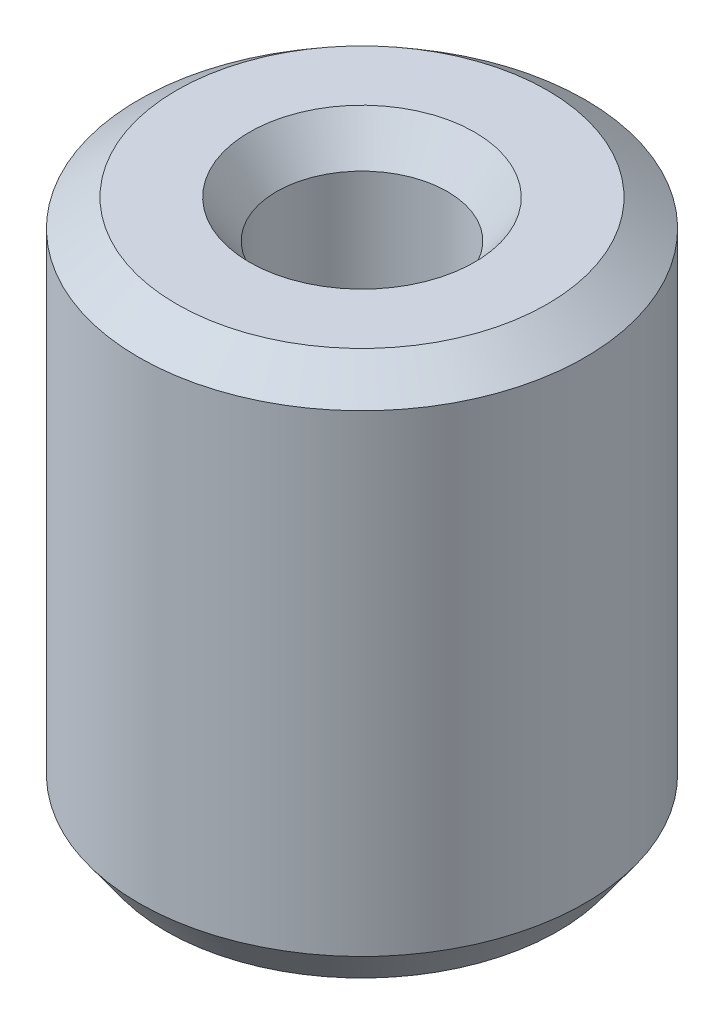
ISO-10303-21;
HEADER;
FILE_DESCRIPTION(('STEP AP214'),'2;1');
FILE_NAME('part.step','',(''),(''),'','','');
FILE_SCHEMA(('AUTOMOTIVE_DESIGN { 1 0 10303 214 1 1 1 1 }'));
ENDSEC;
DATA;
#1=APPLICATION_CONTEXT('core data for automotive mechanical design processes');
#2=APPLICATION_PROTOCOL_DEFINITION('international standard','automotive_design',2000,#1);
#3=PRODUCT_CONTEXT('',#1,'mechanical');
#4=PRODUCT('Part','Part','',(#3));
#5=PRODUCT_RELATED_PRODUCT_CATEGORY('part','',(#4));
#6=PRODUCT_DEFINITION_FORMATION('','',#4);
#7=PRODUCT_DEFINITION_CONTEXT('part definition',#1,'design');
#8=PRODUCT_DEFINITION('design','',#6,#7);
#9=PRODUCT_DEFINITION_SHAPE('','',#8);
#10=(LENGTH_UNIT() NAMED_UNIT(*) SI_UNIT(.MILLI.,.METRE.));
#11=(NAMED_UNIT(*) PLANE_ANGLE_UNIT() SI_UNIT($,.RADIAN.));
#12=(NAMED_UNIT(*) SI_UNIT($,.STERADIAN.) SOLID_ANGLE_UNIT());
#13=UNCERTAINTY_MEASURE_WITH_UNIT(LENGTH_MEASURE(1.E-05),#10,'distance_accuracy_value','');
#14=(GEOMETRIC_REPRESENTATION_CONTEXT(3) GLOBAL_UNCERTAINTY_ASSIGNED_CONTEXT((#13)) GLOBAL_UNIT_ASSIGNED_CONTEXT((#10,
#11,#12)) REPRESENTATION_CONTEXT('',''));
#15=CARTESIAN_POINT('',(0.,0.,0.));
#16=DIRECTION('',(0.,0.,1.));
#17=DIRECTION('',(1.,0.,0.));
#18=AXIS2_PLACEMENT_3D('',#15,#16,#17);
#19=CARTESIAN_POINT('',(0.,78.301453840789,0.));
#20=DIRECTION('',(0.,-1.,0.));
#21=DIRECTION('',(0.,0.,-1.));
#22=AXIS2_PLACEMENT_3D('',#19,#20,#21);
#23=CYLINDRICAL_SURFACE('',#22,32.5);
#24=CARTESIAN_POINT('',(0.,5.51533695774471,0.));
#25=DIRECTION('',(0.,1.,0.));
#26=DIRECTION('',(0.,0.,1.));
#27=AXIS2_PLACEMENT_3D('',#24,#25,#26);
#28=CIRCLE('',#27,32.5);
#29=CARTESIAN_POINT('',(0.,5.5153369577447,-32.5));
#30=VERTEX_POINT('',#29);
#31=EDGE_CURVE('E10',#30,#30,#28,.T.);
#32=CARTESIAN_POINT('',(0.,74.3437350221567,0.));
#33=DIRECTION('',(0.,1.,0.));
#34=DIRECTION('',(0.,0.,1.));
#35=AXIS2_PLACEMENT_3D('',#32,#33,#34);
#36=CIRCLE('',#35,32.5);
#37=CARTESIAN_POINT('',(0.,74.3437350221567,-32.5));
#38=VERTEX_POINT('',#37);
#39=EDGE_CURVE('E50',#38,#38,#36,.F.);
#40=CARTESIAN_POINT('',(0.,5.5153369577447,-32.5));
#41=CARTESIAN_POINT('',(0.,6.23229943758232,-32.5));
#42=CARTESIAN_POINT('',(0.,6.94926191741995,-32.5));
#43=CARTESIAN_POINT('',(0.,8.3831868770952,-32.5));
#44=CARTESIAN_POINT('',(0.,9.10014935693282,-32.5));
#45=CARTESIAN_POINT('',(0.,10.5340743166081,-32.5));
#46=CARTESIAN_POINT('',(0.,11.2510367964457,-32.5));
#47=CARTESIAN_POINT('',(0.,12.684961756121,-32.5));
#48=CARTESIAN_POINT('',(0.,13.4019242359586,-32.5));
#49=CARTESIAN_POINT('',(0.,14.8358491956338,-32.5));
#50=CARTESIAN_POINT('',(0.,15.5528116754715,-32.5));
#51=CARTESIAN_POINT('',(0.,16.9867366351467,-32.5));
#52=CARTESIAN_POINT('',(0.,17.7036991149843,-32.5));
#53=CARTESIAN_POINT('',(0.,19.1376240746596,-32.5));
#54=CARTESIAN_POINT('',(0.,19.8545865544972,-32.5));
#55=CARTESIAN_POINT('',(0.,21.2885115141725,-32.5));
#56=CARTESIAN_POINT('',(0.,22.0054739940101,-32.5));
#57=CARTESIAN_POINT('',(0.,23.4393989536853,-32.5));
#58=CARTESIAN_POINT('',(0.,24.156361433523,-32.5));
#59=CARTESIAN_POINT('',(0.,25.5902863931982,-32.5));
#60=CARTESIAN_POINT('',(0.,26.3072488730358,-32.5));
#61=CARTESIAN_POINT('',(0.,27.7411738327111,-32.5));
#62=CARTESIAN_POINT('',(0.,28.4581363125487,-32.5));
#63=CARTESIAN_POINT('',(0.,29.892061272224,-32.5));
#64=CARTESIAN_POINT('',(0.,30.6090237520616,-32.5));
#65=CARTESIAN_POINT('',(0.,32.0429487117368,-32.5));
#66=CARTESIAN_POINT('',(0.,32.7599111915745,-32.5));
#67=CARTESIAN_POINT('',(0.,34.1938361512497,-32.5));
#68=CARTESIAN_POINT('',(0.,34.9107986310873,-32.5));
#69=CARTESIAN_POINT('',(0.,36.3447235907626,-32.5));
#70=CARTESIAN_POINT('',(0.,37.0616860706002,-32.5));
#71=CARTESIAN_POINT('',(0.,38.4956110302755,-32.5));
#72=CARTESIAN_POINT('',(0.,39.2125735101131,-32.5));
#73=CARTESIAN_POINT('',(0.,40.6464984697883,-32.5));
#74=CARTESIAN_POINT('',(0.,41.363460949626,-32.5));
#75=CARTESIAN_POINT('',(0.,42.7973859093012,-32.5));
#76=CARTESIAN_POINT('',(0.,43.5143483891389,-32.5));
#77=CARTESIAN_POINT('',(0.,44.9482733488141,-32.5));
#78=CARTESIAN_POINT('',(0.,45.6652358286517,-32.5));
#79=CARTESIAN_POINT('',(0.,47.099160788327,-32.5));
#80=CARTESIAN_POINT('',(0.,47.8161232681646,-32.5));
#81=CARTESIAN_POINT('',(0.,49.2500482278399,-32.5));
#82=CARTESIAN_POINT('',(0.,49.9670107076775,-32.5));
#83=CARTESIAN_POINT('',(0.,51.4009356673527,-32.5));
#84=CARTESIAN_POINT('',(0.,52.1178981471904,-32.5));
#85=CARTESIAN_POINT('',(0.,53.5518231068656,-32.5));
#86=CARTESIAN_POINT('',(0.,54.2687855867032,-32.5));
#87=CARTESIAN_POINT('',(0.,55.7027105463785,-32.5));
#88=CARTESIAN_POINT('',(0.,56.4196730262161,-32.5));
#89=CARTESIAN_POINT('',(0.,57.8535979858914,-32.5));
#90=CARTESIAN_POINT('',(0.,58.570560465729,-32.5));
#91=CARTESIAN_POINT('',(0.,60.0044854254042,-32.5));
#92=CARTESIAN_POINT('',(0.,60.7214479052419,-32.5));
#93=CARTESIAN_POINT('',(0.,62.1553728649171,-32.5));
#94=CARTESIAN_POINT('',(0.,62.8723353447547,-32.5));
#95=CARTESIAN_POINT('',(0.,64.30626030443,-32.5));
#96=CARTESIAN_POINT('',(0.,65.0232227842676,-32.5));
#97=CARTESIAN_POINT('',(0.,66.4571477439429,-32.5));
#98=CARTESIAN_POINT('',(0.,67.1741102237805,-32.5));
#99=CARTESIAN_POINT('',(0.,68.6080351834558,-32.5));
#100=CARTESIAN_POINT('',(0.,69.3249976632934,-32.5));
#101=CARTESIAN_POINT('',(0.,70.7589226229686,-32.5));
#102=CARTESIAN_POINT('',(0.,71.4758851028063,-32.5));
#103=CARTESIAN_POINT('',(0.,72.9098100624815,-32.5));
#104=CARTESIAN_POINT('',(0.,73.6267725423191,-32.5));
#105=CARTESIAN_POINT('',(0.,74.3437350221567,-32.5));
#106=B_SPLINE_CURVE_WITH_KNOTS('',3,(#40,#41,#42,#43,#44,#45,#46,#47,#48,#49,#50,#51,#52,#53,
#54,#55,#56,#57,#58,#59,#60,#61,#62,#63,#64,#65,#66,#67,#68,#69,#70,#71,#72,#73,#74,#75,#76,#77,
#78,#79,#80,#81,#82,#83,#84,#85,#86,#87,#88,#89,#90,#91,#92,#93,#94,#95,#96,#97,#98,#99,#100,
#101,#102,#103,#104,#105),.UNSPECIFIED.,.F.,.F.,(4,2,2,2,2,2,2,2,2,2,2,2,2,2,2,2,2,2,2,2,2,2,2,
2,2,2,2,2,2,2,2,2,4),(0.,2.15088743951287,4.30177487902575,6.45266231853864,8.60354975805151,
10.7544371975644,12.9053246370773,15.0562120765901,17.207099516103,19.3579869556159,
21.5088743951288,23.6597618346416,25.8106492741545,27.9615367136674,30.1124241531803,
32.2633115926932,34.414199032206,36.5650864717189,38.7159739112318,40.8668613507447,
43.0177487902575,45.1686362297704,47.3195236692833,49.4704111087962,51.621298548309,
53.7721859878219,55.9230734273348,58.0739608668477,60.2248483063605,62.3757357458734,
64.5266231853863,66.6775106248992,68.8283980644121),.UNSPECIFIED.);
#107=EDGE_CURVE('BSEAM39',#30,#38,#106,.T.);
#108=ORIENTED_EDGE('',*,*,#31,.T.);
#109=ORIENTED_EDGE('',*,*,#39,.T.);
#110=ORIENTED_EDGE('',*,*,#107,.T.);
#111=ORIENTED_EDGE('',*,*,#107,.F.);
#112=EDGE_LOOP('',(#108,#110,#109,#111));
#113=FACE_BOUND('',#112,.T.);
#114=ADVANCED_FACE('F39',(#113),#23,.T.);
#115=CARTESIAN_POINT('',(0.,78.301453840789,0.));
#116=DIRECTION('',(0.,1.,0.));
#117=DIRECTION('',(0.,0.,1.));
#118=AXIS2_PLACEMENT_3D('',#115,#116,#117);
#119=PLANE('',#118);
#120=CARTESIAN_POINT('',(0.,78.301453840789,0.));
#121=DIRECTION('',(0.,1.,0.));
#122=DIRECTION('',(0.,0.,1.));
#123=AXIS2_PLACEMENT_3D('',#120,#121,#122);
#124=CIRCLE('',#123,16.4065281727438);
#125=CARTESIAN_POINT('',(0.,78.301453840789,16.4065281727438));
#126=VERTEX_POINT('',#125);
#127=EDGE_CURVE('E58',#126,#126,#124,.F.);
#128=ORIENTED_EDGE('',*,*,#127,.T.);
#129=EDGE_LOOP('',(#128));
#130=FACE_BOUND('',#129,.T.);
#131=CARTESIAN_POINT('',(0.,78.301453840789,0.));
#132=DIRECTION('',(0.,1.,0.));
#133=DIRECTION('',(0.,0.,1.));
#134=AXIS2_PLACEMENT_3D('',#131,#132,#133);
#135=CIRCLE('',#134,26.9846630422555);
#136=CARTESIAN_POINT('',(0.,78.301453840789,26.9846630422555));
#137=VERTEX_POINT('',#136);
#138=EDGE_CURVE('E61',#137,#137,#135,.T.);
#139=ORIENTED_EDGE('',*,*,#138,.T.);
#140=EDGE_LOOP('',(#139));
#141=FACE_BOUND('',#140,.T.);
#142=ADVANCED_FACE('F88',(#130,#141),#119,.T.);
#143=CARTESIAN_POINT('',(0.,0.,0.));
#144=DIRECTION('',(0.,1.,0.));
#145=DIRECTION('',(0.,0.,1.));
#146=AXIS2_PLACEMENT_3D('',#143,#144,#145);
#147=PLANE('',#146);
#148=CARTESIAN_POINT('',(0.,0.,0.));
#149=DIRECTION('',(0.,1.,0.));
#150=DIRECTION('',(0.,0.,1.));
#151=AXIS2_PLACEMENT_3D('',#148,#149,#150);
#152=CIRCLE('',#151,17.9641463118559);
#153=CARTESIAN_POINT('',(0.,0.,17.9641463118559));
#154=VERTEX_POINT('',#153);
#155=EDGE_CURVE('E51',#154,#154,#152,.T.);
#156=ORIENTED_EDGE('',*,*,#155,.T.);
#157=EDGE_LOOP('',(#156));
#158=FACE_BOUND('',#157,.T.);
#159=CARTESIAN_POINT('',(0.,0.,0.));
#160=DIRECTION('',(0.,1.,0.));
#161=DIRECTION('',(0.,0.,1.));
#162=AXIS2_PLACEMENT_3D('',#159,#160,#161);
#163=CIRCLE('',#162,28.5422811813675);
#164=CARTESIAN_POINT('',(0.,0.,28.5422811813675));
#165=VERTEX_POINT('',#164);
#166=EDGE_CURVE('E54',#165,#165,#163,.F.);
#167=ORIENTED_EDGE('',*,*,#166,.T.);
#168=EDGE_LOOP('',(#167));
#169=FACE_BOUND('',#168,.T.);
#170=ADVANCED_FACE('F83',(#158,#169),#147,.F.);
#171=CARTESIAN_POINT('',(0.,78.301453840789,0.));
#172=DIRECTION('',(0.,-1.,0.));
#173=DIRECTION('',(0.,0.,-1.));
#174=AXIS2_PLACEMENT_3D('',#171,#172,#173);
#175=CYLINDRICAL_SURFACE('',#174,12.4488093541114);
#176=CARTESIAN_POINT('',(0.,72.7861168830445,0.));
#177=DIRECTION('',(0.,1.,0.));
#178=DIRECTION('',(0.,0.,1.));
#179=AXIS2_PLACEMENT_3D('',#176,#177,#178);
#180=CIRCLE('',#179,12.4488093541114);
#181=CARTESIAN_POINT('',(0.,72.7861168830444,-12.4488093541114));
#182=VERTEX_POINT('',#181);
#183=EDGE_CURVE('E67',#182,#182,#180,.T.);
#184=CARTESIAN_POINT('',(0.,3.9577188186323,0.));
#185=DIRECTION('',(0.,1.,0.));
#186=DIRECTION('',(0.,0.,1.));
#187=AXIS2_PLACEMENT_3D('',#184,#185,#186);
#188=CIRCLE('',#187,12.4488093541114);
#189=CARTESIAN_POINT('',(0.,3.9577188186323,-12.4488093541114));
#190=VERTEX_POINT('',#189);
#191=EDGE_CURVE('E69',#190,#190,#188,.F.);
#192=CARTESIAN_POINT('',(0.,72.7861168830444,-12.4488093541114));
#193=CARTESIAN_POINT('',(0.,72.0691544032068,-12.4488093541114));
#194=CARTESIAN_POINT('',(0.,71.3521919233692,-12.4488093541114));
#195=CARTESIAN_POINT('',(0.,69.9182669636939,-12.4488093541114));
#196=CARTESIAN_POINT('',(0.,69.2013044838563,-12.4488093541114));
#197=CARTESIAN_POINT('',(0.,67.7673795241811,-12.4488093541114));
#198=CARTESIAN_POINT('',(0.,67.0504170443434,-12.4488093541114));
#199=CARTESIAN_POINT('',(0.,65.6164920846682,-12.4488093541114));
#200=CARTESIAN_POINT('',(0.,64.8995296048306,-12.4488093541114));
#201=CARTESIAN_POINT('',(0.,63.4656046451553,-12.4488093541114));
#202=CARTESIAN_POINT('',(0.,62.7486421653177,-12.4488093541114));
#203=CARTESIAN_POINT('',(0.,61.3147172056424,-12.4488093541114));
#204=CARTESIAN_POINT('',(0.,60.5977547258048,-12.4488093541114));
#205=CARTESIAN_POINT('',(0.,59.1638297661295,-12.4488093541114));
#206=CARTESIAN_POINT('',(0.,58.4468672862919,-12.4488093541114));
#207=CARTESIAN_POINT('',(0.,57.0129423266167,-12.4488093541114));
#208=CARTESIAN_POINT('',(0.,56.295979846779,-12.4488093541114));
#209=CARTESIAN_POINT('',(0.,54.8620548871038,-12.4488093541114));
#210=CARTESIAN_POINT('',(0.,54.1450924072662,-12.4488093541114));
#211=CARTESIAN_POINT('',(0.,52.7111674475909,-12.4488093541114));
#212=CARTESIAN_POINT('',(0.,51.9942049677533,-12.4488093541114));
#213=CARTESIAN_POINT('',(0.,50.560280008078,-12.4488093541114));
#214=CARTESIAN_POINT('',(0.,49.8433175282404,-12.4488093541114));
#215=CARTESIAN_POINT('',(0.,48.4093925685651,-12.4488093541114));
#216=CARTESIAN_POINT('',(0.,47.6924300887275,-12.4488093541114));
#217=CARTESIAN_POINT('',(0.,46.2585051290523,-12.4488093541114));
#218=CARTESIAN_POINT('',(0.,45.5415426492146,-12.4488093541114));
#219=CARTESIAN_POINT('',(0.,44.1076176895394,-12.4488093541114));
#220=CARTESIAN_POINT('',(0.,43.3906552097018,-12.4488093541114));
#221=CARTESIAN_POINT('',(0.,41.9567302500265,-12.4488093541114));
#222=CARTESIAN_POINT('',(0.,41.2397677701889,-12.4488093541114));
#223=CARTESIAN_POINT('',(0.,39.8058428105136,-12.4488093541114));
#224=CARTESIAN_POINT('',(0.,39.088880330676,-12.4488093541114));
#225=CARTESIAN_POINT('',(0.,37.6549553710007,-12.4488093541114));
#226=CARTESIAN_POINT('',(0.,36.9379928911631,-12.4488093541114));
#227=CARTESIAN_POINT('',(0.,35.5040679314879,-12.4488093541114));
#228=CARTESIAN_POINT('',(0.,34.7871054516502,-12.4488093541114));
#229=CARTESIAN_POINT('',(0.,33.353180491975,-12.4488093541114));
#230=CARTESIAN_POINT('',(0.,32.6362180121374,-12.4488093541114));
#231=CARTESIAN_POINT('',(0.,31.2022930524621,-12.4488093541114));
#232=CARTESIAN_POINT('',(0.,30.4853305726245,-12.4488093541114));
#233=CARTESIAN_POINT('',(0.,29.0514056129492,-12.4488093541114));
#234=CARTESIAN_POINT('',(0.,28.3344431331116,-12.4488093541114));
#235=CARTESIAN_POINT('',(0.,26.9005181734363,-12.4488093541114));
#236=CARTESIAN_POINT('',(0.,26.1835556935987,-12.4488093541114));
#237=CARTESIAN_POINT('',(0.,24.7496307339235,-12.4488093541114));
#238=CARTESIAN_POINT('',(0.,24.0326682540858,-12.4488093541114));
#239=CARTESIAN_POINT('',(0.,22.5987432944106,-12.4488093541114));
#240=CARTESIAN_POINT('',(0.,21.881780814573,-12.4488093541114));
#241=CARTESIAN_POINT('',(0.,20.4478558548977,-12.4488093541114));
#242=CARTESIAN_POINT('',(0.,19.7308933750601,-12.4488093541114));
#243=CARTESIAN_POINT('',(0.,18.2969684153848,-12.4488093541114));
#244=CARTESIAN_POINT('',(0.,17.5800059355472,-12.4488093541114));
#245=CARTESIAN_POINT('',(0.,16.1460809758719,-12.4488093541114));
#246=CARTESIAN_POINT('',(0.,15.4291184960343,-12.4488093541114));
#247=CARTESIAN_POINT('',(0.,13.9951935363591,-12.4488093541114));
#248=CARTESIAN_POINT('',(0.,13.2782310565215,-12.4488093541114));
#249=CARTESIAN_POINT('',(0.,11.8443060968462,-12.4488093541114));
#250=CARTESIAN_POINT('',(0.,11.1273436170086,-12.4488093541114));
#251=CARTESIAN_POINT('',(0.,9.69341865733331,-12.4488093541114));
#252=CARTESIAN_POINT('',(0.,8.97645617749569,-12.4488093541114));
#253=CARTESIAN_POINT('',(0.,7.54253121782043,-12.4488093541114));
#254=CARTESIAN_POINT('',(0.,6.8255687379828,-12.4488093541114));
#255=CARTESIAN_POINT('',(0.,5.39164377830755,-12.4488093541114));
#256=CARTESIAN_POINT('',(0.,4.67468129846992,-12.4488093541114));
#257=CARTESIAN_POINT('',(0.,3.9577188186323,-12.4488093541114));
#258=B_SPLINE_CURVE_WITH_KNOTS('',3,(#192,#193,#194,#195,#196,#197,#198,#199,#200,#201,#202,
#203,#204,#205,#206,#207,#208,#209,#210,#211,#212,#213,#214,#215,#216,#217,#218,#219,#220,#221,
#222,#223,#224,#225,#226,#227,#228,#229,#230,#231,#232,#233,#234,#235,#236,#237,#238,#239,#240,
#241,#242,#243,#244,#245,#246,#247,#248,#249,#250,#251,#252,#253,#254,#255,#256,#257),
.UNSPECIFIED.,.F.,.F.,(4,2,2,2,2,2,2,2,2,2,2,2,2,2,2,2,2,2,2,2,2,2,2,2,2,2,2,2,2,2,2,2,4),(0.,
2.15088743951287,4.30177487902575,6.45266231853864,8.60354975805151,10.7544371975644,
12.9053246370773,15.0562120765901,17.207099516103,19.3579869556159,21.5088743951288,
23.6597618346417,25.8106492741545,27.9615367136674,30.1124241531803,32.2633115926932,
34.4141990322061,36.5650864717189,38.7159739112318,40.8668613507447,43.0177487902576,
45.1686362297705,47.3195236692833,49.4704111087962,51.6212985483091,53.772185987822,
55.9230734273349,58.0739608668477,60.2248483063606,62.3757357458735,64.5266231853864,
66.6775106248993,68.8283980644121),.UNSPECIFIED.);
#259=EDGE_CURVE('BSEAM71',#182,#190,#258,.T.);
#260=ORIENTED_EDGE('',*,*,#183,.T.);
#261=ORIENTED_EDGE('',*,*,#191,.T.);
#262=ORIENTED_EDGE('',*,*,#259,.T.);
#263=ORIENTED_EDGE('',*,*,#259,.F.);
#264=EDGE_LOOP('',(#260,#262,#261,#263));
#265=FACE_BOUND('',#264,.T.);
#266=ADVANCED_FACE('F71',(#265),#175,.F.);
#267=CARTESIAN_POINT('',(0.,72.7861168830445,0.));
#268=DIRECTION('',(0.,1.,0.));
#269=DIRECTION('',(0.,0.,1.));
#270=AXIS2_PLACEMENT_3D('',#267,#268,#269);
#271=CONICAL_SURFACE('',#270,12.4488093541114,0.622430231971725);
#272=ORIENTED_EDGE('',*,*,#127,.F.);
#273=EDGE_LOOP('',(#272));
#274=FACE_BOUND('',#273,.T.);
#275=ORIENTED_EDGE('',*,*,#183,.F.);
#276=EDGE_LOOP('',(#275));
#277=FACE_BOUND('',#276,.T.);
#278=ADVANCED_FACE('F77',(#274,#277),#271,.F.);
#279=CARTESIAN_POINT('',(0.,0.,0.));
#280=DIRECTION('',(0.,-1.,0.));
#281=DIRECTION('',(0.,0.,-1.));
#282=AXIS2_PLACEMENT_3D('',#279,#280,#281);
#283=CONICAL_SURFACE('',#282,17.9641463118559,0.948366094823173);
#284=ORIENTED_EDGE('',*,*,#191,.F.);
#285=EDGE_LOOP('',(#284));
#286=FACE_BOUND('',#285,.T.);
#287=ORIENTED_EDGE('',*,*,#155,.F.);
#288=EDGE_LOOP('',(#287));
#289=FACE_BOUND('',#288,.T.);
#290=ADVANCED_FACE('F73',(#286,#289),#283,.F.);
#291=CARTESIAN_POINT('',(0.,5.51533695774471,0.));
#292=DIRECTION('',(0.,1.,0.));
#293=DIRECTION('',(0.,0.,1.));
#294=AXIS2_PLACEMENT_3D('',#291,#292,#293);
#295=CONICAL_SURFACE('',#294,32.5,0.622430231971723);
#296=ORIENTED_EDGE('',*,*,#166,.F.);
#297=EDGE_LOOP('',(#296));
#298=FACE_BOUND('',#297,.T.);
#299=ORIENTED_EDGE('',*,*,#31,.F.);
#300=EDGE_LOOP('',(#299));
#301=FACE_BOUND('',#300,.T.);
#302=ADVANCED_FACE('F76',(#298,#301),#295,.T.);
#303=CARTESIAN_POINT('',(0.,78.301453840789,0.));
#304=DIRECTION('',(0.,-1.,0.));
#305=DIRECTION('',(0.,0.,-1.));
#306=AXIS2_PLACEMENT_3D('',#303,#304,#305);
#307=CONICAL_SURFACE('',#306,26.9846630422555,0.948366094823175);
#308=ORIENTED_EDGE('',*,*,#39,.F.);
#309=EDGE_LOOP('',(#308));
#310=FACE_BOUND('',#309,.T.);
#311=ORIENTED_EDGE('',*,*,#138,.F.);
#312=EDGE_LOOP('',(#311));
#313=FACE_BOUND('',#312,.T.);
#314=ADVANCED_FACE('F45',(#310,#313),#307,.T.);
#315=CLOSED_SHELL('',(#114,#142,#170,#266,#278,#290,#302,#314));
#316=MANIFOLD_SOLID_BREP('B2',#315);
#317=ADVANCED_BREP_SHAPE_REPRESENTATION('',(#18,#316),#14);
#318=SHAPE_DEFINITION_REPRESENTATION(#9,#317);
ENDSEC;
END-ISO-10303-21;
